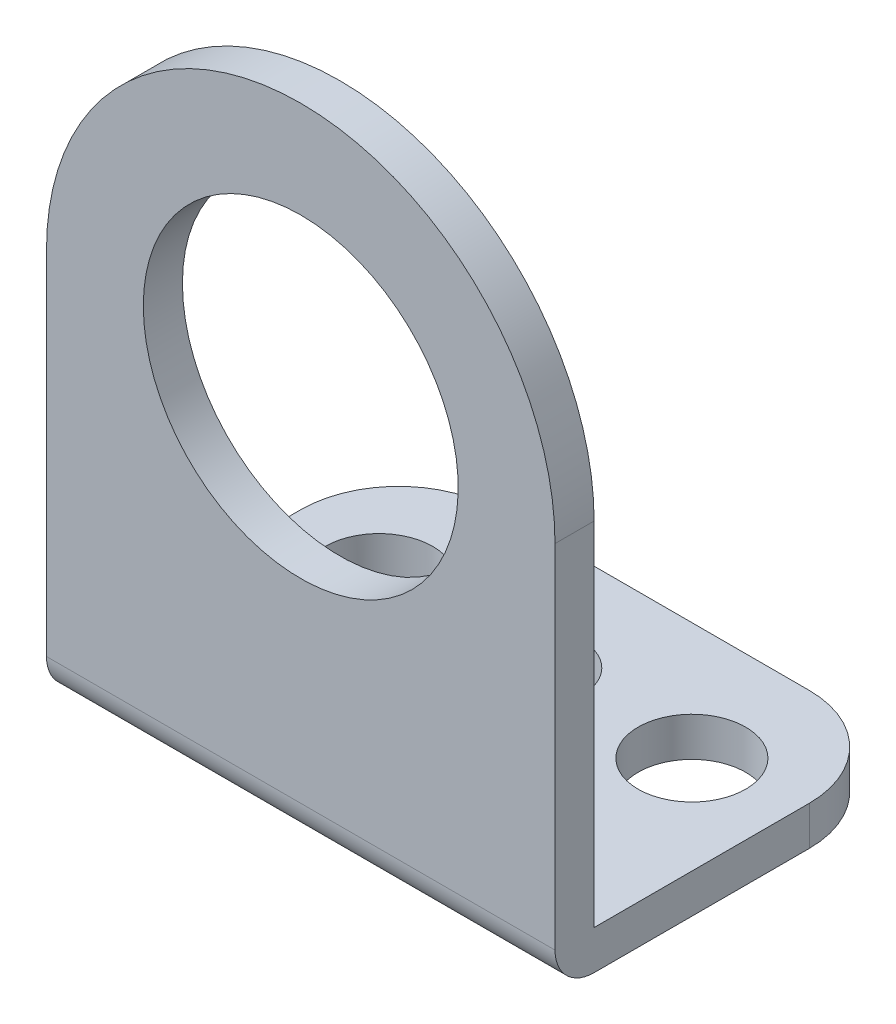
ISO-10303-21;
HEADER;
FILE_DESCRIPTION(('STEP AP214'),'2;1');
FILE_NAME('part.step','',(''),(''),'','','');
FILE_SCHEMA(('AUTOMOTIVE_DESIGN { 1 0 10303 214 1 1 1 1 }'));
ENDSEC;
DATA;
#1=APPLICATION_CONTEXT('core data for automotive mechanical design processes');
#2=APPLICATION_PROTOCOL_DEFINITION('international standard','automotive_design',2000,#1);
#3=PRODUCT_CONTEXT('',#1,'mechanical');
#4=PRODUCT('Part','Part','',(#3));
#5=PRODUCT_RELATED_PRODUCT_CATEGORY('part','',(#4));
#6=PRODUCT_DEFINITION_FORMATION('','',#4);
#7=PRODUCT_DEFINITION_CONTEXT('part definition',#1,'design');
#8=PRODUCT_DEFINITION('design','',#6,#7);
#9=PRODUCT_DEFINITION_SHAPE('','',#8);
#10=(LENGTH_UNIT() NAMED_UNIT(*) SI_UNIT(.MILLI.,.METRE.));
#11=(NAMED_UNIT(*) PLANE_ANGLE_UNIT() SI_UNIT($,.RADIAN.));
#12=(NAMED_UNIT(*) SI_UNIT($,.STERADIAN.) SOLID_ANGLE_UNIT());
#13=UNCERTAINTY_MEASURE_WITH_UNIT(LENGTH_MEASURE(1.E-05),#10,'distance_accuracy_value','');
#14=(GEOMETRIC_REPRESENTATION_CONTEXT(3) GLOBAL_UNCERTAINTY_ASSIGNED_CONTEXT((#13)) GLOBAL_UNIT_ASSIGNED_CONTEXT((#10,
#11,#12)) REPRESENTATION_CONTEXT('',''));
#15=CARTESIAN_POINT('',(0.,0.,0.));
#16=DIRECTION('',(0.,0.,1.));
#17=DIRECTION('',(1.,0.,0.));
#18=AXIS2_PLACEMENT_3D('',#15,#16,#17);
#19=CARTESIAN_POINT('',(13.,7.5,0.));
#20=DIRECTION('',(0.,0.,-1.));
#21=DIRECTION('',(0.,1.,0.));
#22=AXIS2_PLACEMENT_3D('',#19,#20,#21);
#23=PLANE('',#22);
#24=DIRECTION('',(-1.,0.,0.));
#25=VECTOR('',#24,1.);
#26=CARTESIAN_POINT('',(13.,2.,0.));
#27=LINE('',#26,#25);
#28=CARTESIAN_POINT('',(-13.,2.,0.));
#29=VERTEX_POINT('',#28);
#30=CARTESIAN_POINT('',(13.,2.,0.));
#31=VERTEX_POINT('',#30);
#32=EDGE_CURVE('E256',#29,#31,#27,.F.);
#33=ORIENTED_EDGE('',*,*,#32,.T.);
#34=DIRECTION('',(0.,-1.,0.));
#35=VECTOR('',#34,1.);
#36=CARTESIAN_POINT('',(13.,7.5,0.));
#37=LINE('',#36,#35);
#38=CARTESIAN_POINT('',(13.,20.,0.));
#39=VERTEX_POINT('',#38);
#40=EDGE_CURVE('E221',#39,#31,#37,.T.);
#41=ORIENTED_EDGE('',*,*,#40,.F.);
#42=CARTESIAN_POINT('',(0.,20.,0.));
#43=DIRECTION('',(0.,0.,-1.));
#44=DIRECTION('',(0.,1.,0.));
#45=AXIS2_PLACEMENT_3D('',#42,#43,#44);
#46=CIRCLE('',#45,13.);
#47=CARTESIAN_POINT('',(-13.,20.,0.));
#48=VERTEX_POINT('',#47);
#49=EDGE_CURVE('E203',#39,#48,#46,.F.);
#50=ORIENTED_EDGE('',*,*,#49,.T.);
#51=DIRECTION('',(0.,-1.,0.));
#52=VECTOR('',#51,1.);
#53=CARTESIAN_POINT('',(-13.,7.5,0.));
#54=LINE('',#53,#52);
#55=EDGE_CURVE('E220',#48,#29,#54,.T.);
#56=ORIENTED_EDGE('',*,*,#55,.T.);
#57=EDGE_LOOP('',(#33,#41,#50,#56));
#58=FACE_BOUND('',#57,.T.);
#59=CARTESIAN_POINT('',(0.,20.,0.));
#60=DIRECTION('',(0.,0.,-1.));
#61=DIRECTION('',(0.,1.,0.));
#62=AXIS2_PLACEMENT_3D('',#59,#60,#61);
#63=CIRCLE('',#62,8.05);
#64=CARTESIAN_POINT('',(0.,28.05,0.));
#65=VERTEX_POINT('',#64);
#66=EDGE_CURVE('E206',#65,#65,#63,.F.);
#67=ORIENTED_EDGE('',*,*,#66,.F.);
#68=EDGE_LOOP('',(#67));
#69=FACE_BOUND('',#68,.T.);
#70=ADVANCED_FACE('F36',(#58,#69),#23,.F.);
#71=CARTESIAN_POINT('',(13.,0.,0.));
#72=DIRECTION('',(0.,1.,0.));
#73=DIRECTION('',(0.,0.,1.));
#74=AXIS2_PLACEMENT_3D('',#71,#72,#73);
#75=PLANE('',#74);
#76=CARTESIAN_POINT('',(-8.,0.,-12.));
#77=DIRECTION('',(0.,1.,0.));
#78=DIRECTION('',(0.,0.,1.));
#79=AXIS2_PLACEMENT_3D('',#76,#77,#78);
#80=CIRCLE('',#79,2.75);
#81=CARTESIAN_POINT('',(-8.,0.,-9.25000000000001));
#82=VERTEX_POINT('',#81);
#83=EDGE_CURVE('E189',#82,#82,#80,.F.);
#84=ORIENTED_EDGE('',*,*,#83,.F.);
#85=EDGE_LOOP('',(#84));
#86=FACE_BOUND('',#85,.T.);
#87=CARTESIAN_POINT('',(8.,0.,-12.));
#88=DIRECTION('',(0.,1.,0.));
#89=DIRECTION('',(0.,0.,1.));
#90=AXIS2_PLACEMENT_3D('',#87,#88,#89);
#91=CIRCLE('',#90,2.75);
#92=CARTESIAN_POINT('',(8.,0.,-9.25000000000001));
#93=VERTEX_POINT('',#92);
#94=EDGE_CURVE('E188',#93,#93,#91,.F.);
#95=ORIENTED_EDGE('',*,*,#94,.F.);
#96=EDGE_LOOP('',(#95));
#97=FACE_BOUND('',#96,.T.);
#98=CARTESIAN_POINT('',(0.,0.,-12.));
#99=DIRECTION('',(0.,1.,0.));
#100=DIRECTION('',(0.,0.,1.));
#101=AXIS2_PLACEMENT_3D('',#98,#99,#100);
#102=CIRCLE('',#101,2.4);
#103=CARTESIAN_POINT('',(0.,0.,-9.6));
#104=VERTEX_POINT('',#103);
#105=EDGE_CURVE('E199',#104,#104,#102,.F.);
#106=ORIENTED_EDGE('',*,*,#105,.F.);
#107=EDGE_LOOP('',(#106));
#108=FACE_BOUND('',#107,.T.);
#109=DIRECTION('',(-1.,0.,0.));
#110=VECTOR('',#109,1.);
#111=CARTESIAN_POINT('',(13.,0.,-2.));
#112=LINE('',#111,#110);
#113=CARTESIAN_POINT('',(13.,0.,-2.));
#114=VERTEX_POINT('',#113);
#115=CARTESIAN_POINT('',(-13.,0.,-2.));
#116=VERTEX_POINT('',#115);
#117=EDGE_CURVE('E252',#114,#116,#112,.T.);
#118=ORIENTED_EDGE('',*,*,#117,.T.);
#119=DIRECTION('',(0.,0.,-1.));
#120=VECTOR('',#119,1.);
#121=CARTESIAN_POINT('',(-13.,0.,0.));
#122=LINE('',#121,#120);
#123=CARTESIAN_POINT('',(-13.,0.,-13.));
#124=VERTEX_POINT('',#123);
#125=EDGE_CURVE('E235',#116,#124,#122,.T.);
#126=ORIENTED_EDGE('',*,*,#125,.T.);
#127=CARTESIAN_POINT('',(-8.,0.,-13.));
#128=DIRECTION('',(0.,1.,0.));
#129=DIRECTION('',(0.,0.,1.));
#130=AXIS2_PLACEMENT_3D('',#127,#128,#129);
#131=CIRCLE('',#130,5.);
#132=CARTESIAN_POINT('',(-7.99999999999999,0.,-18.));
#133=VERTEX_POINT('',#132);
#134=EDGE_CURVE('E272',#124,#133,#131,.F.);
#135=ORIENTED_EDGE('',*,*,#134,.T.);
#136=DIRECTION('',(-1.,0.,0.));
#137=VECTOR('',#136,1.);
#138=CARTESIAN_POINT('',(13.,0.,-18.));
#139=LINE('',#138,#137);
#140=CARTESIAN_POINT('',(8.,0.,-18.));
#141=VERTEX_POINT('',#140);
#142=EDGE_CURVE('E249',#141,#133,#139,.T.);
#143=ORIENTED_EDGE('',*,*,#142,.F.);
#144=CARTESIAN_POINT('',(8.,0.,-13.));
#145=DIRECTION('',(0.,1.,0.));
#146=DIRECTION('',(0.,0.,1.));
#147=AXIS2_PLACEMENT_3D('',#144,#145,#146);
#148=CIRCLE('',#147,5.);
#149=CARTESIAN_POINT('',(13.,0.,-13.));
#150=VERTEX_POINT('',#149);
#151=EDGE_CURVE('E274',#141,#150,#148,.F.);
#152=ORIENTED_EDGE('',*,*,#151,.T.);
#153=DIRECTION('',(0.,0.,-1.));
#154=VECTOR('',#153,1.);
#155=CARTESIAN_POINT('',(13.,0.,0.));
#156=LINE('',#155,#154);
#157=EDGE_CURVE('E224',#114,#150,#156,.T.);
#158=ORIENTED_EDGE('',*,*,#157,.F.);
#159=EDGE_LOOP('',(#118,#126,#135,#143,#152,#158));
#160=FACE_BOUND('',#159,.T.);
#161=ADVANCED_FACE('F301',(#86,#97,#108,#160),#75,.F.);
#162=CARTESIAN_POINT('',(13.,2.,-18.));
#163=DIRECTION('',(0.,0.,1.));
#164=DIRECTION('',(1.,0.,0.));
#165=AXIS2_PLACEMENT_3D('',#162,#163,#164);
#166=PLANE('',#165);
#167=DIRECTION('',(-1.,0.,0.));
#168=VECTOR('',#167,1.);
#169=CARTESIAN_POINT('',(13.,2.,-18.));
#170=LINE('',#169,#168);
#171=CARTESIAN_POINT('',(8.,2.,-18.));
#172=VERTEX_POINT('',#171);
#173=CARTESIAN_POINT('',(-7.99999999999999,2.,-18.));
#174=VERTEX_POINT('',#173);
#175=EDGE_CURVE('E245',#172,#174,#170,.T.);
#176=ORIENTED_EDGE('',*,*,#175,.F.);
#177=DIRECTION('',(0.,1.,0.));
#178=VECTOR('',#177,1.);
#179=CARTESIAN_POINT('',(8.,0.,-18.));
#180=LINE('',#179,#178);
#181=EDGE_CURVE('E270',#172,#141,#180,.F.);
#182=ORIENTED_EDGE('',*,*,#181,.T.);
#183=ORIENTED_EDGE('',*,*,#142,.T.);
#184=DIRECTION('',(0.,1.,0.));
#185=VECTOR('',#184,1.);
#186=CARTESIAN_POINT('',(-8.,2.,-18.));
#187=LINE('',#186,#185);
#188=EDGE_CURVE('E267',#133,#174,#187,.T.);
#189=ORIENTED_EDGE('',*,*,#188,.T.);
#190=EDGE_LOOP('',(#176,#182,#183,#189));
#191=FACE_BOUND('',#190,.T.);
#192=ADVANCED_FACE('F307',(#191),#166,.F.);
#193=CARTESIAN_POINT('',(13.,2.,-2.));
#194=DIRECTION('',(0.,-1.,0.));
#195=DIRECTION('',(0.,0.,-1.));
#196=AXIS2_PLACEMENT_3D('',#193,#194,#195);
#197=PLANE('',#196);
#198=CARTESIAN_POINT('',(-8.,2.,-12.));
#199=DIRECTION('',(0.,1.,0.));
#200=DIRECTION('',(0.,0.,-1.));
#201=AXIS2_PLACEMENT_3D('',#198,#199,#200);
#202=CIRCLE('',#201,2.75);
#203=CARTESIAN_POINT('',(-8.,2.,-14.75));
#204=VERTEX_POINT('',#203);
#205=EDGE_CURVE('E184',#204,#204,#202,.T.);
#206=ORIENTED_EDGE('',*,*,#205,.F.);
#207=EDGE_LOOP('',(#206));
#208=FACE_BOUND('',#207,.T.);
#209=CARTESIAN_POINT('',(8.,2.,-12.));
#210=DIRECTION('',(0.,1.,0.));
#211=DIRECTION('',(0.,0.,1.));
#212=AXIS2_PLACEMENT_3D('',#209,#210,#211);
#213=CIRCLE('',#212,2.75);
#214=CARTESIAN_POINT('',(8.,2.,-9.25000000000001));
#215=VERTEX_POINT('',#214);
#216=EDGE_CURVE('E185',#215,#215,#213,.T.);
#217=ORIENTED_EDGE('',*,*,#216,.F.);
#218=EDGE_LOOP('',(#217));
#219=FACE_BOUND('',#218,.T.);
#220=CARTESIAN_POINT('',(0.,2.,-12.));
#221=DIRECTION('',(0.,1.,0.));
#222=DIRECTION('',(0.,0.,1.));
#223=AXIS2_PLACEMENT_3D('',#220,#221,#222);
#224=CIRCLE('',#223,2.4);
#225=CARTESIAN_POINT('',(0.,2.,-9.6));
#226=VERTEX_POINT('',#225);
#227=EDGE_CURVE('E192',#226,#226,#224,.T.);
#228=ORIENTED_EDGE('',*,*,#227,.F.);
#229=EDGE_LOOP('',(#228));
#230=FACE_BOUND('',#229,.T.);
#231=DIRECTION('',(-1.,0.,0.));
#232=VECTOR('',#231,1.);
#233=CARTESIAN_POINT('',(13.,2.,-7.));
#234=LINE('',#233,#232);
#235=CARTESIAN_POINT('',(-5.,2.,-7.));
#236=VERTEX_POINT('',#235);
#237=CARTESIAN_POINT('',(-3.,2.,-7.));
#238=VERTEX_POINT('',#237);
#239=EDGE_CURVE('E51',#236,#238,#234,.F.);
#240=ORIENTED_EDGE('',*,*,#239,.T.);
#241=DIRECTION('',(0.377964473009228,0.,0.925820099772551));
#242=VECTOR('',#241,1.);
#243=CARTESIAN_POINT('',(1.03534981627371,2.,2.88454798350441));
#244=LINE('',#243,#242);
#245=CARTESIAN_POINT('',(-0.958758547680677,2.,-2.));
#246=VERTEX_POINT('',#245);
#247=EDGE_CURVE('E163',#238,#246,#244,.T.);
#248=ORIENTED_EDGE('',*,*,#247,.T.);
#249=DIRECTION('',(-1.,0.,0.));
#250=VECTOR('',#249,1.);
#251=CARTESIAN_POINT('',(13.,2.,-2.));
#252=LINE('',#251,#250);
#253=CARTESIAN_POINT('',(0.958758547680684,2.,-2.));
#254=VERTEX_POINT('',#253);
#255=EDGE_CURVE('E246',#254,#246,#252,.T.);
#256=ORIENTED_EDGE('',*,*,#255,.F.);
#257=DIRECTION('',(-0.377964473009228,0.,0.925820099772551));
#258=VECTOR('',#257,1.);
#259=CARTESIAN_POINT('',(2.67893589801202,2.,-6.21355677540455));
#260=LINE('',#259,#258);
#261=CARTESIAN_POINT('',(3.,2.,-7.));
#262=VERTEX_POINT('',#261);
#263=EDGE_CURVE('E175',#262,#254,#260,.T.);
#264=ORIENTED_EDGE('',*,*,#263,.F.);
#265=DIRECTION('',(-1.,0.,0.));
#266=VECTOR('',#265,1.);
#267=CARTESIAN_POINT('',(13.,2.,-7.));
#268=LINE('',#267,#266);
#269=CARTESIAN_POINT('',(5.,2.,-7.));
#270=VERTEX_POINT('',#269);
#271=EDGE_CURVE('E182',#262,#270,#268,.F.);
#272=ORIENTED_EDGE('',*,*,#271,.T.);
#273=DIRECTION('',(0.377964473009228,0.,0.925820099772551));
#274=VECTOR('',#273,1.);
#275=CARTESIAN_POINT('',(7.89249267341657,2.,0.0851311346093445));
#276=LINE('',#275,#274);
#277=CARTESIAN_POINT('',(7.04124145231933,2.,-2.));
#278=VERTEX_POINT('',#277);
#279=EDGE_CURVE('E180',#270,#278,#276,.T.);
#280=ORIENTED_EDGE('',*,*,#279,.T.);
#281=CARTESIAN_POINT('',(13.,2.,-2.));
#282=VERTEX_POINT('',#281);
#283=EDGE_CURVE('E242',#282,#278,#252,.T.);
#284=ORIENTED_EDGE('',*,*,#283,.F.);
#285=DIRECTION('',(0.,0.,1.));
#286=VECTOR('',#285,1.);
#287=CARTESIAN_POINT('',(13.,2.,-2.));
#288=LINE('',#287,#286);
#289=CARTESIAN_POINT('',(13.,2.,-13.));
#290=VERTEX_POINT('',#289);
#291=EDGE_CURVE('E228',#290,#282,#288,.T.);
#292=ORIENTED_EDGE('',*,*,#291,.F.);
#293=CARTESIAN_POINT('',(8.,2.,-13.));
#294=DIRECTION('',(0.,-1.,0.));
#295=DIRECTION('',(0.,0.,-1.));
#296=AXIS2_PLACEMENT_3D('',#293,#294,#295);
#297=CIRCLE('',#296,5.);
#298=EDGE_CURVE('E265',#290,#172,#297,.F.);
#299=ORIENTED_EDGE('',*,*,#298,.T.);
#300=ORIENTED_EDGE('',*,*,#175,.T.);
#301=CARTESIAN_POINT('',(-8.,2.,-13.));
#302=DIRECTION('',(0.,-1.,0.));
#303=DIRECTION('',(0.,0.,-1.));
#304=AXIS2_PLACEMENT_3D('',#301,#302,#303);
#305=CIRCLE('',#304,5.);
#306=CARTESIAN_POINT('',(-13.,2.,-13.));
#307=VERTEX_POINT('',#306);
#308=EDGE_CURVE('E263',#174,#307,#305,.F.);
#309=ORIENTED_EDGE('',*,*,#308,.T.);
#310=DIRECTION('',(0.,0.,1.));
#311=VECTOR('',#310,1.);
#312=CARTESIAN_POINT('',(-13.,2.,-2.));
#313=LINE('',#312,#311);
#314=CARTESIAN_POINT('',(-13.,2.,-2.));
#315=VERTEX_POINT('',#314);
#316=EDGE_CURVE('E238',#307,#315,#313,.T.);
#317=ORIENTED_EDGE('',*,*,#316,.T.);
#318=CARTESIAN_POINT('',(-7.04124145231933,2.,-2.));
#319=VERTEX_POINT('',#318);
#320=EDGE_CURVE('E232',#319,#315,#252,.T.);
#321=ORIENTED_EDGE('',*,*,#320,.F.);
#322=DIRECTION('',(-0.377964473009228,0.,0.925820099772551));
#323=VECTOR('',#322,1.);
#324=CARTESIAN_POINT('',(-4.17820695913084,2.,-9.01297362429962));
#325=LINE('',#324,#323);
#326=EDGE_CURVE('E56',#236,#319,#325,.T.);
#327=ORIENTED_EDGE('',*,*,#326,.F.);
#328=EDGE_LOOP('',(#240,#248,#256,#264,#272,#280,#284,#292,#299,#300,#309,#317,#321,#327));
#329=FACE_BOUND('',#328,.T.);
#330=ADVANCED_FACE('F288',(#208,#219,#230,#329),#197,.F.);
#331=CARTESIAN_POINT('',(13.,7.5,-2.));
#332=DIRECTION('',(0.,0.,1.));
#333=DIRECTION('',(0.,-1.,0.));
#334=AXIS2_PLACEMENT_3D('',#331,#332,#333);
#335=PLANE('',#334);
#336=ORIENTED_EDGE('',*,*,#255,.T.);
#337=DIRECTION('',(-0.377964473009228,0.925820099772551,0.));
#338=VECTOR('',#337,1.);
#339=CARTESIAN_POINT('',(-0.889249267341644,1.8297377307813,-2.));
#340=LINE('',#339,#338);
#341=CARTESIAN_POINT('',(-3.,7.,-2.));
#342=VERTEX_POINT('',#341);
#343=EDGE_CURVE('E146',#246,#342,#340,.T.);
#344=ORIENTED_EDGE('',*,*,#343,.T.);
#345=DIRECTION('',(1.,0.,0.));
#346=VECTOR('',#345,1.);
#347=CARTESIAN_POINT('',(13.,7.,-2.));
#348=LINE('',#347,#346);
#349=CARTESIAN_POINT('',(-5.,7.,-2.));
#350=VERTEX_POINT('',#349);
#351=EDGE_CURVE('E11',#342,#350,#348,.F.);
#352=ORIENTED_EDGE('',*,*,#351,.T.);
#353=DIRECTION('',(0.377964473009228,0.925820099772551,0.));
#354=VECTOR('',#353,1.);
#355=CARTESIAN_POINT('',(-2.25360787551548,13.7272593385853,-2.));
#356=LINE('',#355,#354);
#357=EDGE_CURVE('E144',#319,#350,#356,.T.);
#358=ORIENTED_EDGE('',*,*,#357,.F.);
#359=ORIENTED_EDGE('',*,*,#320,.T.);
#360=DIRECTION('',(0.,1.,0.));
#361=VECTOR('',#360,1.);
#362=CARTESIAN_POINT('',(-13.,7.5,-2.));
#363=LINE('',#362,#361);
#364=CARTESIAN_POINT('',(-13.,20.,-2.));
#365=VERTEX_POINT('',#364);
#366=EDGE_CURVE('E225',#315,#365,#363,.T.);
#367=ORIENTED_EDGE('',*,*,#366,.T.);
#368=CARTESIAN_POINT('',(0.,20.,-2.));
#369=DIRECTION('',(0.,0.,-1.));
#370=DIRECTION('',(1.,0.,0.));
#371=AXIS2_PLACEMENT_3D('',#368,#369,#370);
#372=CIRCLE('',#371,13.);
#373=CARTESIAN_POINT('',(13.,20.,-2.));
#374=VERTEX_POINT('',#373);
#375=EDGE_CURVE('E210',#365,#374,#372,.T.);
#376=ORIENTED_EDGE('',*,*,#375,.T.);
#377=DIRECTION('',(0.,1.,0.));
#378=VECTOR('',#377,1.);
#379=CARTESIAN_POINT('',(13.,7.5,-2.));
#380=LINE('',#379,#378);
#381=EDGE_CURVE('E230',#282,#374,#380,.T.);
#382=ORIENTED_EDGE('',*,*,#381,.F.);
#383=ORIENTED_EDGE('',*,*,#283,.T.);
#384=DIRECTION('',(-0.377964473009228,0.925820099772551,0.));
#385=VECTOR('',#384,1.);
#386=CARTESIAN_POINT('',(5.96789358980121,4.62915457967636,-2.));
#387=LINE('',#386,#385);
#388=CARTESIAN_POINT('',(5.,7.,-2.));
#389=VERTEX_POINT('',#388);
#390=EDGE_CURVE('E178',#278,#389,#387,.T.);
#391=ORIENTED_EDGE('',*,*,#390,.T.);
#392=DIRECTION('',(1.,0.,0.));
#393=VECTOR('',#392,1.);
#394=CARTESIAN_POINT('',(13.,7.,-2.));
#395=LINE('',#394,#393);
#396=CARTESIAN_POINT('',(3.,7.,-2.));
#397=VERTEX_POINT('',#396);
#398=EDGE_CURVE('E44',#389,#397,#395,.F.);
#399=ORIENTED_EDGE('',*,*,#398,.T.);
#400=DIRECTION('',(0.377964473009228,0.925820099772551,0.));
#401=VECTOR('',#400,1.);
#402=CARTESIAN_POINT('',(4.60353498162738,10.9278424896903,-2.));
#403=LINE('',#402,#401);
#404=EDGE_CURVE('E170',#254,#397,#403,.T.);
#405=ORIENTED_EDGE('',*,*,#404,.F.);
#406=EDGE_LOOP('',(#336,#344,#352,#358,#359,#367,#376,#382,#383,#391,#399,#405));
#407=FACE_BOUND('',#406,.T.);
#408=CARTESIAN_POINT('',(0.,20.,-2.));
#409=DIRECTION('',(0.,0.,-1.));
#410=DIRECTION('',(-1.,0.,0.));
#411=AXIS2_PLACEMENT_3D('',#408,#409,#410);
#412=CIRCLE('',#411,8.05);
#413=CARTESIAN_POINT('',(-8.05,20.,-2.));
#414=VERTEX_POINT('',#413);
#415=EDGE_CURVE('E202',#414,#414,#412,.T.);
#416=ORIENTED_EDGE('',*,*,#415,.F.);
#417=EDGE_LOOP('',(#416));
#418=FACE_BOUND('',#417,.T.);
#419=ADVANCED_FACE('F142',(#407,#418),#335,.F.);
#420=CARTESIAN_POINT('',(13.,0.,0.));
#421=DIRECTION('',(1.,0.,0.));
#422=DIRECTION('',(0.,0.,-1.));
#423=AXIS2_PLACEMENT_3D('',#420,#421,#422);
#424=PLANE('',#423);
#425=ORIENTED_EDGE('',*,*,#157,.T.);
#426=DIRECTION('',(0.,1.,0.));
#427=VECTOR('',#426,1.);
#428=CARTESIAN_POINT('',(13.,2.,-13.));
#429=LINE('',#428,#427);
#430=EDGE_CURVE('E260',#150,#290,#429,.T.);
#431=ORIENTED_EDGE('',*,*,#430,.T.);
#432=ORIENTED_EDGE('',*,*,#291,.T.);
#433=ORIENTED_EDGE('',*,*,#381,.T.);
#434=DIRECTION('',(0.,0.,-1.));
#435=VECTOR('',#434,1.);
#436=CARTESIAN_POINT('',(13.,20.,36.4177154692603));
#437=LINE('',#436,#435);
#438=EDGE_CURVE('E213',#39,#374,#437,.T.);
#439=ORIENTED_EDGE('',*,*,#438,.F.);
#440=ORIENTED_EDGE('',*,*,#40,.T.);
#441=CARTESIAN_POINT('',(13.,2.,-2.));
#442=DIRECTION('',(1.,0.,0.));
#443=DIRECTION('',(0.,0.,-1.));
#444=AXIS2_PLACEMENT_3D('',#441,#442,#443);
#445=CIRCLE('',#444,2.);
#446=EDGE_CURVE('E258',#31,#114,#445,.T.);
#447=ORIENTED_EDGE('',*,*,#446,.T.);
#448=EDGE_LOOP('',(#425,#431,#432,#433,#439,#440,#447));
#449=FACE_BOUND('',#448,.T.);
#450=ADVANCED_FACE('F338',(#449),#424,.T.);
#451=CARTESIAN_POINT('',(-13.,0.,0.));
#452=DIRECTION('',(1.,0.,0.));
#453=DIRECTION('',(0.,0.,-1.));
#454=AXIS2_PLACEMENT_3D('',#451,#452,#453);
#455=PLANE('',#454);
#456=ORIENTED_EDGE('',*,*,#316,.F.);
#457=DIRECTION('',(0.,1.,0.));
#458=VECTOR('',#457,1.);
#459=CARTESIAN_POINT('',(-13.,0.,-13.));
#460=LINE('',#459,#458);
#461=EDGE_CURVE('E276',#307,#124,#460,.F.);
#462=ORIENTED_EDGE('',*,*,#461,.T.);
#463=ORIENTED_EDGE('',*,*,#125,.F.);
#464=CARTESIAN_POINT('',(-13.,2.,-2.));
#465=DIRECTION('',(1.,0.,0.));
#466=DIRECTION('',(0.,0.,-1.));
#467=AXIS2_PLACEMENT_3D('',#464,#465,#466);
#468=CIRCLE('',#467,2.);
#469=EDGE_CURVE('E254',#116,#29,#468,.F.);
#470=ORIENTED_EDGE('',*,*,#469,.T.);
#471=ORIENTED_EDGE('',*,*,#55,.F.);
#472=DIRECTION('',(0.,0.,-1.));
#473=VECTOR('',#472,1.);
#474=CARTESIAN_POINT('',(-13.,20.,36.4177154692603));
#475=LINE('',#474,#473);
#476=EDGE_CURVE('E207',#48,#365,#475,.T.);
#477=ORIENTED_EDGE('',*,*,#476,.T.);
#478=ORIENTED_EDGE('',*,*,#366,.F.);
#479=EDGE_LOOP('',(#456,#462,#463,#470,#471,#477,#478));
#480=FACE_BOUND('',#479,.T.);
#481=ADVANCED_FACE('F359',(#480),#455,.F.);
#482=CARTESIAN_POINT('',(0.,20.,36.4177154692603));
#483=DIRECTION('',(0.,0.,-1.));
#484=DIRECTION('',(-1.,0.,0.));
#485=AXIS2_PLACEMENT_3D('',#482,#483,#484);
#486=CYLINDRICAL_SURFACE('',#485,13.);
#487=ORIENTED_EDGE('',*,*,#49,.F.);
#488=ORIENTED_EDGE('',*,*,#438,.T.);
#489=ORIENTED_EDGE('',*,*,#375,.F.);
#490=ORIENTED_EDGE('',*,*,#476,.F.);
#491=EDGE_LOOP('',(#487,#488,#489,#490));
#492=FACE_BOUND('',#491,.T.);
#493=ADVANCED_FACE('F356',(#492),#486,.T.);
#494=CARTESIAN_POINT('',(0.,20.,36.4177154692603));
#495=DIRECTION('',(0.,0.,-1.));
#496=DIRECTION('',(-1.,0.,0.));
#497=AXIS2_PLACEMENT_3D('',#494,#495,#496);
#498=CYLINDRICAL_SURFACE('',#497,8.05);
#499=ORIENTED_EDGE('',*,*,#66,.T.);
#500=EDGE_LOOP('',(#499));
#501=FACE_BOUND('',#500,.T.);
#502=ORIENTED_EDGE('',*,*,#415,.T.);
#503=EDGE_LOOP('',(#502));
#504=FACE_BOUND('',#503,.T.);
#505=ADVANCED_FACE('F316',(#501,#504),#498,.F.);
#506=CARTESIAN_POINT('',(13.,2.,-2.));
#507=DIRECTION('',(-1.,0.,0.));
#508=DIRECTION('',(0.,0.,1.));
#509=AXIS2_PLACEMENT_3D('',#506,#507,#508);
#510=CYLINDRICAL_SURFACE('',#509,2.);
#511=ORIENTED_EDGE('',*,*,#446,.F.);
#512=ORIENTED_EDGE('',*,*,#32,.F.);
#513=ORIENTED_EDGE('',*,*,#469,.F.);
#514=ORIENTED_EDGE('',*,*,#117,.F.);
#515=EDGE_LOOP('',(#511,#512,#513,#514));
#516=FACE_BOUND('',#515,.T.);
#517=ADVANCED_FACE('F313',(#516),#510,.T.);
#518=CARTESIAN_POINT('',(0.,-7.77817459305202,-12.));
#519=DIRECTION('',(0.,1.,0.));
#520=DIRECTION('',(0.,0.,1.));
#521=AXIS2_PLACEMENT_3D('',#518,#519,#520);
#522=CYLINDRICAL_SURFACE('',#521,2.4);
#523=ORIENTED_EDGE('',*,*,#105,.T.);
#524=EDGE_LOOP('',(#523));
#525=FACE_BOUND('',#524,.T.);
#526=ORIENTED_EDGE('',*,*,#227,.T.);
#527=EDGE_LOOP('',(#526));
#528=FACE_BOUND('',#527,.T.);
#529=ADVANCED_FACE('F315',(#525,#528),#522,.F.);
#530=CARTESIAN_POINT('',(8.,-7.77817459305202,-12.));
#531=DIRECTION('',(0.,1.,0.));
#532=DIRECTION('',(0.,0.,1.));
#533=AXIS2_PLACEMENT_3D('',#530,#531,#532);
#534=CYLINDRICAL_SURFACE('',#533,2.75);
#535=ORIENTED_EDGE('',*,*,#94,.T.);
#536=EDGE_LOOP('',(#535));
#537=FACE_BOUND('',#536,.T.);
#538=ORIENTED_EDGE('',*,*,#216,.T.);
#539=EDGE_LOOP('',(#538));
#540=FACE_BOUND('',#539,.T.);
#541=ADVANCED_FACE('F327',(#537,#540),#534,.F.);
#542=CARTESIAN_POINT('',(-8.,-7.77817459305202,-12.));
#543=DIRECTION('',(0.,1.,0.));
#544=DIRECTION('',(0.,0.,1.));
#545=AXIS2_PLACEMENT_3D('',#542,#543,#544);
#546=CYLINDRICAL_SURFACE('',#545,2.75);
#547=ORIENTED_EDGE('',*,*,#83,.T.);
#548=EDGE_LOOP('',(#547));
#549=FACE_BOUND('',#548,.T.);
#550=ORIENTED_EDGE('',*,*,#205,.T.);
#551=EDGE_LOOP('',(#550));
#552=FACE_BOUND('',#551,.T.);
#553=ADVANCED_FACE('F320',(#549,#552),#546,.F.);
#554=CARTESIAN_POINT('',(8.,0.,-13.));
#555=DIRECTION('',(0.,-1.,0.));
#556=DIRECTION('',(0.,0.,-1.));
#557=AXIS2_PLACEMENT_3D('',#554,#555,#556);
#558=CYLINDRICAL_SURFACE('',#557,5.);
#559=ORIENTED_EDGE('',*,*,#151,.F.);
#560=ORIENTED_EDGE('',*,*,#181,.F.);
#561=ORIENTED_EDGE('',*,*,#298,.F.);
#562=ORIENTED_EDGE('',*,*,#430,.F.);
#563=EDGE_LOOP('',(#559,#560,#561,#562));
#564=FACE_BOUND('',#563,.T.);
#565=ADVANCED_FACE('F318',(#564),#558,.T.);
#566=CARTESIAN_POINT('',(-8.,2.,-13.));
#567=DIRECTION('',(0.,1.,0.));
#568=DIRECTION('',(0.,0.,1.));
#569=AXIS2_PLACEMENT_3D('',#566,#567,#568);
#570=CYLINDRICAL_SURFACE('',#569,5.);
#571=ORIENTED_EDGE('',*,*,#134,.F.);
#572=ORIENTED_EDGE('',*,*,#461,.F.);
#573=ORIENTED_EDGE('',*,*,#308,.F.);
#574=ORIENTED_EDGE('',*,*,#188,.F.);
#575=EDGE_LOOP('',(#571,#572,#573,#574));
#576=FACE_BOUND('',#575,.T.);
#577=ADVANCED_FACE('F38',(#576),#570,.T.);
#578=CARTESIAN_POINT('',(4.,7.,-2.));
#579=DIRECTION('',(0.,-0.707106781186548,0.707106781186547));
#580=DIRECTION('',(0.,-0.707106781186547,-0.707106781186548));
#581=AXIS2_PLACEMENT_3D('',#578,#579,#580);
#582=PLANE('',#581);
#583=ORIENTED_EDGE('',*,*,#271,.F.);
#584=DIRECTION('',(0.,-0.707106781186547,-0.707106781186548));
#585=VECTOR('',#584,1.);
#586=CARTESIAN_POINT('',(3.,8.25,-0.750000000000001));
#587=LINE('',#586,#585);
#588=EDGE_CURVE('E166',#397,#262,#587,.T.);
#589=ORIENTED_EDGE('',*,*,#588,.F.);
#590=ORIENTED_EDGE('',*,*,#398,.F.);
#591=DIRECTION('',(0.,0.707106781186547,0.707106781186548));
#592=VECTOR('',#591,1.);
#593=CARTESIAN_POINT('',(5.,7.,-2.));
#594=LINE('',#593,#592);
#595=EDGE_CURVE('E167',#389,#270,#594,.F.);
#596=ORIENTED_EDGE('',*,*,#595,.T.);
#597=EDGE_LOOP('',(#583,#589,#590,#596));
#598=FACE_BOUND('',#597,.T.);
#599=ADVANCED_FACE('F286',(#598),#582,.F.);
#600=CARTESIAN_POINT('',(5.,8.25,-0.750000000000001));
#601=DIRECTION('',(0.866025403784438,0.353553390593275,-0.353553390593274));
#602=DIRECTION('',(-0.377964473009228,0.925820099772551,0.));
#603=AXIS2_PLACEMENT_3D('',#600,#601,#602);
#604=PLANE('',#603);
#605=ORIENTED_EDGE('',*,*,#279,.F.);
#606=ORIENTED_EDGE('',*,*,#595,.F.);
#607=ORIENTED_EDGE('',*,*,#390,.F.);
#608=EDGE_LOOP('',(#605,#606,#607));
#609=FACE_BOUND('',#608,.T.);
#610=ADVANCED_FACE('F291',(#609),#604,.T.);
#611=CARTESIAN_POINT('',(3.,8.25,-0.750000000000001));
#612=DIRECTION('',(0.866025403784438,-0.353553390593275,0.353553390593274));
#613=DIRECTION('',(0.377964473009228,0.925820099772551,0.));
#614=AXIS2_PLACEMENT_3D('',#611,#612,#613);
#615=PLANE('',#614);
#616=ORIENTED_EDGE('',*,*,#588,.T.);
#617=ORIENTED_EDGE('',*,*,#263,.T.);
#618=ORIENTED_EDGE('',*,*,#404,.T.);
#619=EDGE_LOOP('',(#616,#617,#618));
#620=FACE_BOUND('',#619,.T.);
#621=ADVANCED_FACE('F284',(#620),#615,.F.);
#622=CARTESIAN_POINT('',(-4.,7.,-2.));
#623=DIRECTION('',(0.,-0.707106781186548,0.707106781186547));
#624=DIRECTION('',(0.,-0.707106781186547,-0.707106781186548));
#625=AXIS2_PLACEMENT_3D('',#622,#623,#624);
#626=PLANE('',#625);
#627=ORIENTED_EDGE('',*,*,#239,.F.);
#628=DIRECTION('',(0.,-0.707106781186547,-0.707106781186548));
#629=VECTOR('',#628,1.);
#630=CARTESIAN_POINT('',(-5.,8.25,-0.750000000000001));
#631=LINE('',#630,#629);
#632=EDGE_CURVE('E154',#350,#236,#631,.T.);
#633=ORIENTED_EDGE('',*,*,#632,.F.);
#634=ORIENTED_EDGE('',*,*,#351,.F.);
#635=DIRECTION('',(0.,0.707106781186547,0.707106781186548));
#636=VECTOR('',#635,1.);
#637=CARTESIAN_POINT('',(-3.,7.,-2.));
#638=LINE('',#637,#636);
#639=EDGE_CURVE('E155',#342,#238,#638,.F.);
#640=ORIENTED_EDGE('',*,*,#639,.T.);
#641=EDGE_LOOP('',(#627,#633,#634,#640));
#642=FACE_BOUND('',#641,.T.);
#643=ADVANCED_FACE('F157',(#642),#626,.F.);
#644=CARTESIAN_POINT('',(-3.,8.25,-0.750000000000001));
#645=DIRECTION('',(0.866025403784438,0.353553390593275,-0.353553390593274));
#646=DIRECTION('',(-0.377964473009228,0.925820099772551,0.));
#647=AXIS2_PLACEMENT_3D('',#644,#645,#646);
#648=PLANE('',#647);
#649=ORIENTED_EDGE('',*,*,#247,.F.);
#650=ORIENTED_EDGE('',*,*,#639,.F.);
#651=ORIENTED_EDGE('',*,*,#343,.F.);
#652=EDGE_LOOP('',(#649,#650,#651));
#653=FACE_BOUND('',#652,.T.);
#654=ADVANCED_FACE('F459',(#653),#648,.T.);
#655=CARTESIAN_POINT('',(-5.,8.25,-0.750000000000001));
#656=DIRECTION('',(0.866025403784438,-0.353553390593275,0.353553390593274));
#657=DIRECTION('',(0.377964473009228,0.925820099772551,0.));
#658=AXIS2_PLACEMENT_3D('',#655,#656,#657);
#659=PLANE('',#658);
#660=ORIENTED_EDGE('',*,*,#632,.T.);
#661=ORIENTED_EDGE('',*,*,#326,.T.);
#662=ORIENTED_EDGE('',*,*,#357,.T.);
#663=EDGE_LOOP('',(#660,#661,#662));
#664=FACE_BOUND('',#663,.T.);
#665=ADVANCED_FACE('F153',(#664),#659,.F.);
#666=CLOSED_SHELL('',(#70,#161,#192,#330,#419,#450,#481,#493,#505,#517,#529,#541,#553,#565,#577,
#599,#610,#621,#643,#654,#665));
#667=MANIFOLD_SOLID_BREP('B2',#666);
#668=ADVANCED_BREP_SHAPE_REPRESENTATION('',(#18,#667),#14);
#669=SHAPE_DEFINITION_REPRESENTATION(#9,#668);
ENDSEC;
END-ISO-10303-21;
